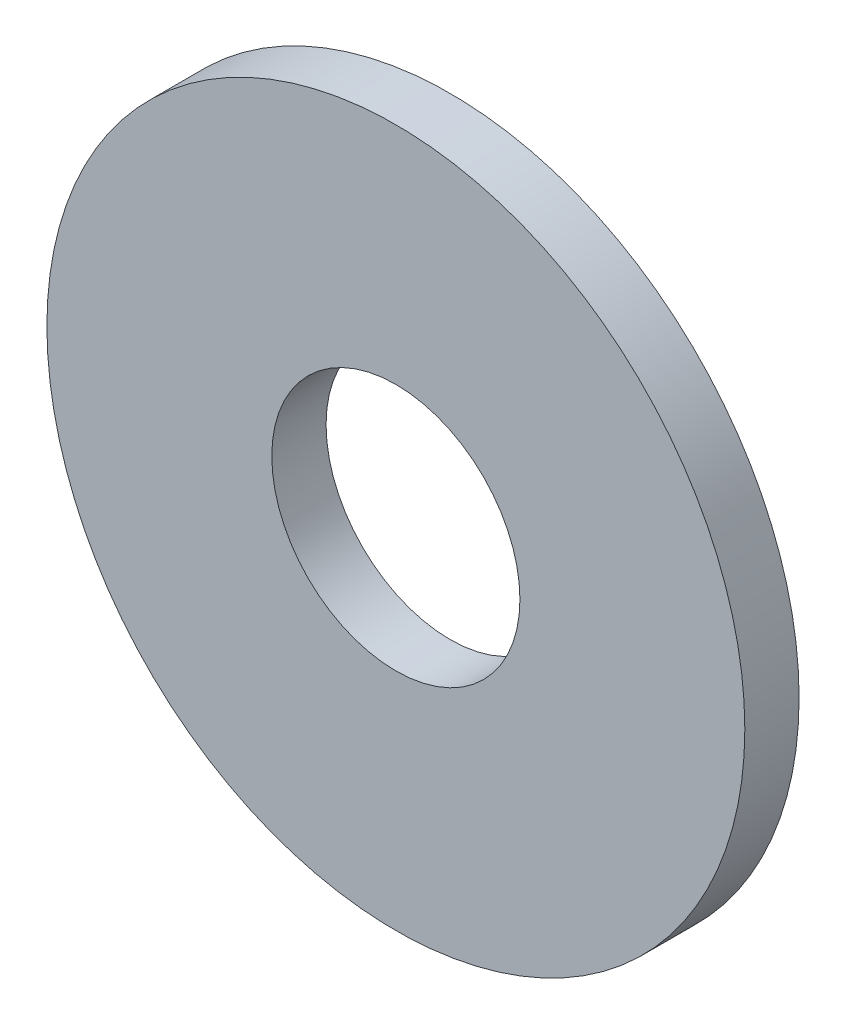
ISO-10303-21;
HEADER;
FILE_DESCRIPTION(('STEP AP214'),'2;1');
FILE_NAME('part.step','',(''),(''),'','','');
FILE_SCHEMA(('AUTOMOTIVE_DESIGN { 1 0 10303 214 1 1 1 1 }'));
ENDSEC;
DATA;
#1=APPLICATION_CONTEXT('core data for automotive mechanical design processes');
#2=APPLICATION_PROTOCOL_DEFINITION('international standard','automotive_design',2000,#1);
#3=PRODUCT_CONTEXT('',#1,'mechanical');
#4=PRODUCT('Part','Part','',(#3));
#5=PRODUCT_RELATED_PRODUCT_CATEGORY('part','',(#4));
#6=PRODUCT_DEFINITION_FORMATION('','',#4);
#7=PRODUCT_DEFINITION_CONTEXT('part definition',#1,'design');
#8=PRODUCT_DEFINITION('design','',#6,#7);
#9=PRODUCT_DEFINITION_SHAPE('','',#8);
#10=(LENGTH_UNIT() NAMED_UNIT(*) SI_UNIT(.MILLI.,.METRE.));
#11=(NAMED_UNIT(*) PLANE_ANGLE_UNIT() SI_UNIT($,.RADIAN.));
#12=(NAMED_UNIT(*) SI_UNIT($,.STERADIAN.) SOLID_ANGLE_UNIT());
#13=UNCERTAINTY_MEASURE_WITH_UNIT(LENGTH_MEASURE(1.E-05),#10,'distance_accuracy_value','');
#14=(GEOMETRIC_REPRESENTATION_CONTEXT(3) GLOBAL_UNCERTAINTY_ASSIGNED_CONTEXT((#13)) GLOBAL_UNIT_ASSIGNED_CONTEXT((#10,
#11,#12)) REPRESENTATION_CONTEXT('',''));
#15=CARTESIAN_POINT('',(0.,0.,0.));
#16=DIRECTION('',(0.,0.,1.));
#17=DIRECTION('',(1.,0.,0.));
#18=AXIS2_PLACEMENT_3D('',#15,#16,#17);
#19=CARTESIAN_POINT('',(0.,0.,-0.7));
#20=DIRECTION('',(0.,0.,1.));
#21=DIRECTION('',(1.,0.,0.));
#22=AXIS2_PLACEMENT_3D('',#19,#20,#21);
#23=CYLINDRICAL_SURFACE('',#22,4.5);
#24=CARTESIAN_POINT('',(0.,0.,-0.7));
#25=DIRECTION('',(0.,0.,1.));
#26=DIRECTION('',(1.,0.,0.));
#27=AXIS2_PLACEMENT_3D('',#24,#25,#26);
#28=CIRCLE('',#27,4.5);
#29=CARTESIAN_POINT('',(4.5,0.,-0.7));
#30=VERTEX_POINT('',#29);
#31=EDGE_CURVE('E10',#30,#30,#28,.T.);
#32=ORIENTED_EDGE('',*,*,#31,.T.);
#33=EDGE_LOOP('',(#32));
#34=FACE_BOUND('',#33,.T.);
#35=CARTESIAN_POINT('',(0.,0.,0.));
#36=DIRECTION('',(0.,0.,1.));
#37=DIRECTION('',(1.,0.,0.));
#38=AXIS2_PLACEMENT_3D('',#35,#36,#37);
#39=CIRCLE('',#38,4.5);
#40=CARTESIAN_POINT('',(4.5,0.,0.));
#41=VERTEX_POINT('',#40);
#42=EDGE_CURVE('E35',#41,#41,#39,.T.);
#43=ORIENTED_EDGE('',*,*,#42,.F.);
#44=EDGE_LOOP('',(#43));
#45=FACE_BOUND('',#44,.T.);
#46=ADVANCED_FACE('F32',(#34,#45),#23,.T.);
#47=CARTESIAN_POINT('',(0.,0.,-0.7));
#48=DIRECTION('',(0.,0.,1.));
#49=DIRECTION('',(1.,0.,0.));
#50=AXIS2_PLACEMENT_3D('',#47,#48,#49);
#51=PLANE('',#50);
#52=CARTESIAN_POINT('',(0.,0.,-0.7));
#53=DIRECTION('',(0.,0.,1.));
#54=DIRECTION('',(1.,0.,0.));
#55=AXIS2_PLACEMENT_3D('',#52,#53,#54);
#56=CIRCLE('',#55,1.6);
#57=CARTESIAN_POINT('',(1.6,0.,-0.7));
#58=VERTEX_POINT('',#57);
#59=EDGE_CURVE('E42',#58,#58,#56,.T.);
#60=ORIENTED_EDGE('',*,*,#59,.T.);
#61=EDGE_LOOP('',(#60));
#62=FACE_BOUND('',#61,.T.);
#63=ORIENTED_EDGE('',*,*,#31,.F.);
#64=EDGE_LOOP('',(#63));
#65=FACE_BOUND('',#64,.T.);
#66=ADVANCED_FACE('F50',(#62,#65),#51,.F.);
#67=CARTESIAN_POINT('',(0.,0.,0.));
#68=DIRECTION('',(0.,0.,1.));
#69=DIRECTION('',(1.,0.,0.));
#70=AXIS2_PLACEMENT_3D('',#67,#68,#69);
#71=PLANE('',#70);
#72=CARTESIAN_POINT('',(0.,0.,0.));
#73=DIRECTION('',(0.,0.,1.));
#74=DIRECTION('',(1.,0.,0.));
#75=AXIS2_PLACEMENT_3D('',#72,#73,#74);
#76=CIRCLE('',#75,1.6);
#77=CARTESIAN_POINT('',(1.6,0.,0.));
#78=VERTEX_POINT('',#77);
#79=EDGE_CURVE('E44',#78,#78,#76,.T.);
#80=ORIENTED_EDGE('',*,*,#79,.F.);
#81=EDGE_LOOP('',(#80));
#82=FACE_BOUND('',#81,.T.);
#83=ORIENTED_EDGE('',*,*,#42,.T.);
#84=EDGE_LOOP('',(#83));
#85=FACE_BOUND('',#84,.T.);
#86=ADVANCED_FACE('F56',(#82,#85),#71,.T.);
#87=CARTESIAN_POINT('',(0.,0.,-0.7));
#88=DIRECTION('',(0.,0.,1.));
#89=DIRECTION('',(1.,0.,0.));
#90=AXIS2_PLACEMENT_3D('',#87,#88,#89);
#91=CYLINDRICAL_SURFACE('',#90,1.6);
#92=ORIENTED_EDGE('',*,*,#59,.F.);
#93=EDGE_LOOP('',(#92));
#94=FACE_BOUND('',#93,.T.);
#95=ORIENTED_EDGE('',*,*,#79,.T.);
#96=EDGE_LOOP('',(#95));
#97=FACE_BOUND('',#96,.T.);
#98=ADVANCED_FACE('F53',(#94,#97),#91,.F.);
#99=CLOSED_SHELL('',(#46,#66,#86,#98));
#100=MANIFOLD_SOLID_BREP('B2',#99);
#101=ADVANCED_BREP_SHAPE_REPRESENTATION('',(#18,#100),#14);
#102=SHAPE_DEFINITION_REPRESENTATION(#9,#101);
ENDSEC;
END-ISO-10303-21;
